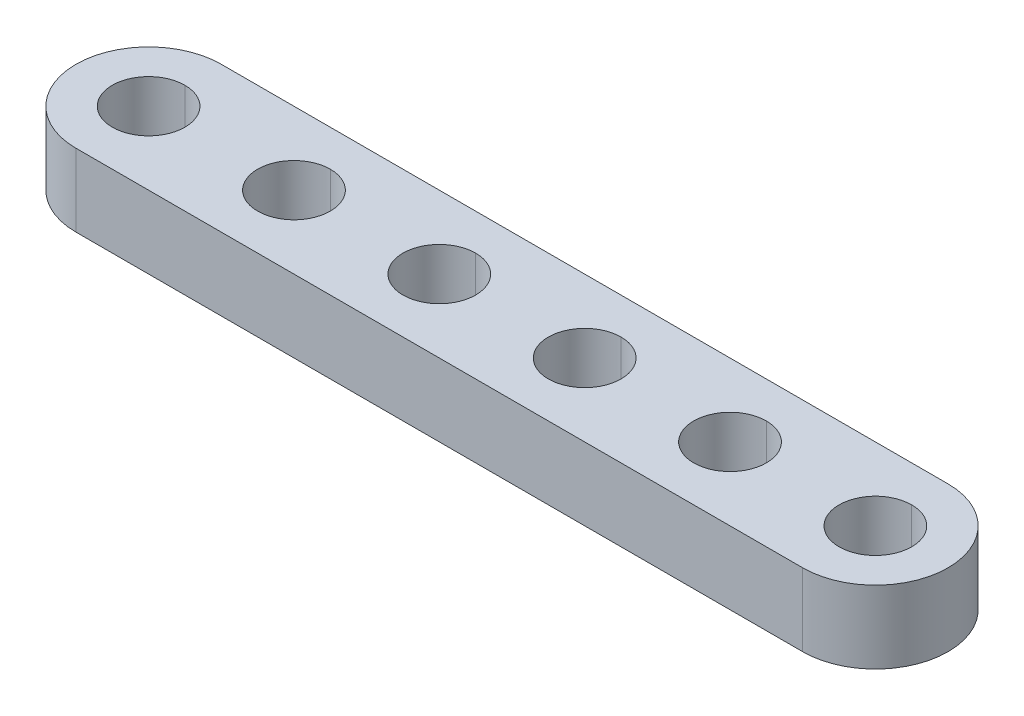
ISO-10303-21;
HEADER;
FILE_DESCRIPTION(('STEP AP214'),'2;1');
FILE_NAME('part.step','',(''),(''),'','','');
FILE_SCHEMA(('AUTOMOTIVE_DESIGN { 1 0 10303 214 1 1 1 1 }'));
ENDSEC;
DATA;
#1=APPLICATION_CONTEXT('core data for automotive mechanical design processes');
#2=APPLICATION_PROTOCOL_DEFINITION('international standard','automotive_design',2000,#1);
#3=PRODUCT_CONTEXT('',#1,'mechanical');
#4=PRODUCT('Part','Part','',(#3));
#5=PRODUCT_RELATED_PRODUCT_CATEGORY('part','',(#4));
#6=PRODUCT_DEFINITION_FORMATION('','',#4);
#7=PRODUCT_DEFINITION_CONTEXT('part definition',#1,'design');
#8=PRODUCT_DEFINITION('design','',#6,#7);
#9=PRODUCT_DEFINITION_SHAPE('','',#8);
#10=(LENGTH_UNIT() NAMED_UNIT(*) SI_UNIT(.MILLI.,.METRE.));
#11=(NAMED_UNIT(*) PLANE_ANGLE_UNIT() SI_UNIT($,.RADIAN.));
#12=(NAMED_UNIT(*) SI_UNIT($,.STERADIAN.) SOLID_ANGLE_UNIT());
#13=UNCERTAINTY_MEASURE_WITH_UNIT(LENGTH_MEASURE(1.E-05),#10,'distance_accuracy_value','');
#14=(GEOMETRIC_REPRESENTATION_CONTEXT(3) GLOBAL_UNCERTAINTY_ASSIGNED_CONTEXT((#13)) GLOBAL_UNIT_ASSIGNED_CONTEXT((#10,
#11,#12)) REPRESENTATION_CONTEXT('',''));
#15=CARTESIAN_POINT('',(0.,0.,0.));
#16=DIRECTION('',(0.,0.,1.));
#17=DIRECTION('',(1.,0.,0.));
#18=AXIS2_PLACEMENT_3D('',#15,#16,#17);
#19=CARTESIAN_POINT('',(20.,4.,0.));
#20=DIRECTION('',(0.,1.,0.));
#21=DIRECTION('',(0.,0.,1.));
#22=AXIS2_PLACEMENT_3D('',#19,#20,#21);
#23=CYLINDRICAL_SURFACE('',#22,2.);
#24=DIRECTION('',(0.,1.,0.));
#25=VECTOR('',#24,1.);
#26=CARTESIAN_POINT('',(20.,4.,-2.));
#27=LINE('',#26,#25);
#28=CARTESIAN_POINT('',(20.,0.,-2.));
#29=VERTEX_POINT('',#28);
#30=CARTESIAN_POINT('',(20.,4.,-2.));
#31=VERTEX_POINT('',#30);
#32=EDGE_CURVE('E175',#29,#31,#27,.T.);
#33=ORIENTED_EDGE('',*,*,#32,.F.);
#34=CARTESIAN_POINT('',(20.,0.,0.));
#35=DIRECTION('',(0.,1.,0.));
#36=DIRECTION('',(0.,0.,1.));
#37=AXIS2_PLACEMENT_3D('',#34,#35,#36);
#38=CIRCLE('',#37,2.);
#39=CARTESIAN_POINT('',(20.,0.,2.));
#40=VERTEX_POINT('',#39);
#41=EDGE_CURVE('E234',#40,#29,#38,.T.);
#42=ORIENTED_EDGE('',*,*,#41,.F.);
#43=DIRECTION('',(0.,1.,0.));
#44=VECTOR('',#43,1.);
#45=CARTESIAN_POINT('',(20.,4.,2.));
#46=LINE('',#45,#44);
#47=CARTESIAN_POINT('',(20.,4.,2.));
#48=VERTEX_POINT('',#47);
#49=EDGE_CURVE('E174',#40,#48,#46,.T.);
#50=ORIENTED_EDGE('',*,*,#49,.T.);
#51=CARTESIAN_POINT('',(20.,4.,0.));
#52=DIRECTION('',(0.,1.,0.));
#53=DIRECTION('',(0.,0.,1.));
#54=AXIS2_PLACEMENT_3D('',#51,#52,#53);
#55=CIRCLE('',#54,2.);
#56=EDGE_CURVE('E218',#48,#31,#55,.T.);
#57=ORIENTED_EDGE('',*,*,#56,.T.);
#58=EDGE_LOOP('',(#33,#42,#50,#57));
#59=FACE_BOUND('',#58,.T.);
#60=ADVANCED_FACE('F15',(#59),#23,.F.);
#61=CARTESIAN_POINT('',(12.,4.,0.));
#62=DIRECTION('',(0.,1.,0.));
#63=DIRECTION('',(0.,0.,1.));
#64=AXIS2_PLACEMENT_3D('',#61,#62,#63);
#65=CYLINDRICAL_SURFACE('',#64,2.);
#66=DIRECTION('',(0.,1.,0.));
#67=VECTOR('',#66,1.);
#68=CARTESIAN_POINT('',(12.,4.,-2.));
#69=LINE('',#68,#67);
#70=CARTESIAN_POINT('',(12.,0.,-2.));
#71=VERTEX_POINT('',#70);
#72=CARTESIAN_POINT('',(12.,4.,-2.));
#73=VERTEX_POINT('',#72);
#74=EDGE_CURVE('E198',#71,#73,#69,.T.);
#75=ORIENTED_EDGE('',*,*,#74,.F.);
#76=CARTESIAN_POINT('',(12.,0.,0.));
#77=DIRECTION('',(0.,1.,0.));
#78=DIRECTION('',(0.,0.,1.));
#79=AXIS2_PLACEMENT_3D('',#76,#77,#78);
#80=CIRCLE('',#79,2.);
#81=CARTESIAN_POINT('',(12.,0.,2.));
#82=VERTEX_POINT('',#81);
#83=EDGE_CURVE('E237',#82,#71,#80,.T.);
#84=ORIENTED_EDGE('',*,*,#83,.F.);
#85=DIRECTION('',(0.,1.,0.));
#86=VECTOR('',#85,1.);
#87=CARTESIAN_POINT('',(12.,4.,2.));
#88=LINE('',#87,#86);
#89=CARTESIAN_POINT('',(12.,4.,2.));
#90=VERTEX_POINT('',#89);
#91=EDGE_CURVE('E244',#82,#90,#88,.T.);
#92=ORIENTED_EDGE('',*,*,#91,.T.);
#93=CARTESIAN_POINT('',(12.,4.,0.));
#94=DIRECTION('',(0.,1.,0.));
#95=DIRECTION('',(0.,0.,1.));
#96=AXIS2_PLACEMENT_3D('',#93,#94,#95);
#97=CIRCLE('',#96,2.);
#98=EDGE_CURVE('E307',#90,#73,#97,.T.);
#99=ORIENTED_EDGE('',*,*,#98,.T.);
#100=EDGE_LOOP('',(#75,#84,#92,#99));
#101=FACE_BOUND('',#100,.T.);
#102=ADVANCED_FACE('F389',(#101),#65,.F.);
#103=CARTESIAN_POINT('',(4.,4.,0.));
#104=DIRECTION('',(0.,1.,0.));
#105=DIRECTION('',(0.,0.,1.));
#106=AXIS2_PLACEMENT_3D('',#103,#104,#105);
#107=CYLINDRICAL_SURFACE('',#106,2.);
#108=DIRECTION('',(0.,1.,0.));
#109=VECTOR('',#108,1.);
#110=CARTESIAN_POINT('',(4.,4.,-2.));
#111=LINE('',#110,#109);
#112=CARTESIAN_POINT('',(4.,0.,-2.));
#113=VERTEX_POINT('',#112);
#114=CARTESIAN_POINT('',(4.,4.,-2.));
#115=VERTEX_POINT('',#114);
#116=EDGE_CURVE('E243',#113,#115,#111,.T.);
#117=ORIENTED_EDGE('',*,*,#116,.F.);
#118=CARTESIAN_POINT('',(4.,0.,0.));
#119=DIRECTION('',(0.,1.,0.));
#120=DIRECTION('',(0.,0.,1.));
#121=AXIS2_PLACEMENT_3D('',#118,#119,#120);
#122=CIRCLE('',#121,2.);
#123=CARTESIAN_POINT('',(4.,0.,2.));
#124=VERTEX_POINT('',#123);
#125=EDGE_CURVE('E19',#124,#113,#122,.T.);
#126=ORIENTED_EDGE('',*,*,#125,.F.);
#127=DIRECTION('',(0.,1.,0.));
#128=VECTOR('',#127,1.);
#129=CARTESIAN_POINT('',(4.,4.,2.));
#130=LINE('',#129,#128);
#131=CARTESIAN_POINT('',(4.,4.,2.));
#132=VERTEX_POINT('',#131);
#133=EDGE_CURVE('E158',#124,#132,#130,.T.);
#134=ORIENTED_EDGE('',*,*,#133,.T.);
#135=CARTESIAN_POINT('',(4.,4.,0.));
#136=DIRECTION('',(0.,1.,0.));
#137=DIRECTION('',(0.,0.,1.));
#138=AXIS2_PLACEMENT_3D('',#135,#136,#137);
#139=CIRCLE('',#138,2.);
#140=EDGE_CURVE('E317',#132,#115,#139,.T.);
#141=ORIENTED_EDGE('',*,*,#140,.T.);
#142=EDGE_LOOP('',(#117,#126,#134,#141));
#143=FACE_BOUND('',#142,.T.);
#144=ADVANCED_FACE('F395',(#143),#107,.F.);
#145=CARTESIAN_POINT('',(-4.,4.,0.));
#146=DIRECTION('',(0.,1.,0.));
#147=DIRECTION('',(0.,0.,1.));
#148=AXIS2_PLACEMENT_3D('',#145,#146,#147);
#149=CYLINDRICAL_SURFACE('',#148,2.);
#150=DIRECTION('',(0.,1.,0.));
#151=VECTOR('',#150,1.);
#152=CARTESIAN_POINT('',(-4.,4.,-2.));
#153=LINE('',#152,#151);
#154=CARTESIAN_POINT('',(-4.,0.,-2.));
#155=VERTEX_POINT('',#154);
#156=CARTESIAN_POINT('',(-4.,4.,-2.));
#157=VERTEX_POINT('',#156);
#158=EDGE_CURVE('E146',#155,#157,#153,.T.);
#159=ORIENTED_EDGE('',*,*,#158,.F.);
#160=CARTESIAN_POINT('',(-4.,0.,0.));
#161=DIRECTION('',(0.,1.,0.));
#162=DIRECTION('',(0.,0.,1.));
#163=AXIS2_PLACEMENT_3D('',#160,#161,#162);
#164=CIRCLE('',#163,2.);
#165=CARTESIAN_POINT('',(-4.,0.,2.));
#166=VERTEX_POINT('',#165);
#167=EDGE_CURVE('E134',#166,#155,#164,.T.);
#168=ORIENTED_EDGE('',*,*,#167,.F.);
#169=DIRECTION('',(0.,1.,0.));
#170=VECTOR('',#169,1.);
#171=CARTESIAN_POINT('',(-4.,4.,2.));
#172=LINE('',#171,#170);
#173=CARTESIAN_POINT('',(-4.,4.,2.));
#174=VERTEX_POINT('',#173);
#175=EDGE_CURVE('E156',#166,#174,#172,.T.);
#176=ORIENTED_EDGE('',*,*,#175,.T.);
#177=CARTESIAN_POINT('',(-4.,4.,0.));
#178=DIRECTION('',(0.,1.,0.));
#179=DIRECTION('',(0.,0.,1.));
#180=AXIS2_PLACEMENT_3D('',#177,#178,#179);
#181=CIRCLE('',#180,2.);
#182=EDGE_CURVE('E148',#174,#157,#181,.T.);
#183=ORIENTED_EDGE('',*,*,#182,.T.);
#184=EDGE_LOOP('',(#159,#168,#176,#183));
#185=FACE_BOUND('',#184,.T.);
#186=ADVANCED_FACE('F147',(#185),#149,.F.);
#187=CARTESIAN_POINT('',(-12.,4.,0.));
#188=DIRECTION('',(0.,1.,0.));
#189=DIRECTION('',(0.,0.,1.));
#190=AXIS2_PLACEMENT_3D('',#187,#188,#189);
#191=CYLINDRICAL_SURFACE('',#190,2.);
#192=DIRECTION('',(0.,1.,0.));
#193=VECTOR('',#192,1.);
#194=CARTESIAN_POINT('',(-12.,4.,-2.));
#195=LINE('',#194,#193);
#196=CARTESIAN_POINT('',(-12.,0.,-2.));
#197=VERTEX_POINT('',#196);
#198=CARTESIAN_POINT('',(-12.,4.,-2.));
#199=VERTEX_POINT('',#198);
#200=EDGE_CURVE('E247',#197,#199,#195,.T.);
#201=ORIENTED_EDGE('',*,*,#200,.F.);
#202=CARTESIAN_POINT('',(-12.,0.,0.));
#203=DIRECTION('',(0.,1.,0.));
#204=DIRECTION('',(0.,0.,1.));
#205=AXIS2_PLACEMENT_3D('',#202,#203,#204);
#206=CIRCLE('',#205,2.);
#207=CARTESIAN_POINT('',(-12.,0.,2.));
#208=VERTEX_POINT('',#207);
#209=EDGE_CURVE('E26',#208,#197,#206,.T.);
#210=ORIENTED_EDGE('',*,*,#209,.F.);
#211=DIRECTION('',(0.,1.,0.));
#212=VECTOR('',#211,1.);
#213=CARTESIAN_POINT('',(-12.,4.,2.));
#214=LINE('',#213,#212);
#215=CARTESIAN_POINT('',(-12.,4.,2.));
#216=VERTEX_POINT('',#215);
#217=EDGE_CURVE('E176',#208,#216,#214,.T.);
#218=ORIENTED_EDGE('',*,*,#217,.T.);
#219=CARTESIAN_POINT('',(-12.,4.,0.));
#220=DIRECTION('',(0.,1.,0.));
#221=DIRECTION('',(0.,0.,1.));
#222=AXIS2_PLACEMENT_3D('',#219,#220,#221);
#223=CIRCLE('',#222,2.);
#224=EDGE_CURVE('E235',#216,#199,#223,.T.);
#225=ORIENTED_EDGE('',*,*,#224,.T.);
#226=EDGE_LOOP('',(#201,#210,#218,#225));
#227=FACE_BOUND('',#226,.T.);
#228=ADVANCED_FACE('F437',(#227),#191,.F.);
#229=CARTESIAN_POINT('',(-20.,4.,0.));
#230=DIRECTION('',(0.,1.,0.));
#231=DIRECTION('',(0.,0.,1.));
#232=AXIS2_PLACEMENT_3D('',#229,#230,#231);
#233=CYLINDRICAL_SURFACE('',#232,2.);
#234=DIRECTION('',(0.,1.,0.));
#235=VECTOR('',#234,1.);
#236=CARTESIAN_POINT('',(-20.,4.,-2.));
#237=LINE('',#236,#235);
#238=CARTESIAN_POINT('',(-20.,0.,-2.));
#239=VERTEX_POINT('',#238);
#240=CARTESIAN_POINT('',(-20.,4.,-2.));
#241=VERTEX_POINT('',#240);
#242=EDGE_CURVE('E275',#239,#241,#237,.T.);
#243=ORIENTED_EDGE('',*,*,#242,.F.);
#244=CARTESIAN_POINT('',(-20.,0.,0.));
#245=DIRECTION('',(0.,1.,0.));
#246=DIRECTION('',(0.,0.,1.));
#247=AXIS2_PLACEMENT_3D('',#244,#245,#246);
#248=CIRCLE('',#247,2.);
#249=CARTESIAN_POINT('',(-20.,0.,2.));
#250=VERTEX_POINT('',#249);
#251=EDGE_CURVE('E10',#250,#239,#248,.T.);
#252=ORIENTED_EDGE('',*,*,#251,.F.);
#253=DIRECTION('',(0.,1.,0.));
#254=VECTOR('',#253,1.);
#255=CARTESIAN_POINT('',(-20.,4.,2.));
#256=LINE('',#255,#254);
#257=CARTESIAN_POINT('',(-20.,4.,2.));
#258=VERTEX_POINT('',#257);
#259=EDGE_CURVE('E182',#250,#258,#256,.T.);
#260=ORIENTED_EDGE('',*,*,#259,.T.);
#261=CARTESIAN_POINT('',(-20.,4.,0.));
#262=DIRECTION('',(0.,1.,0.));
#263=DIRECTION('',(0.,0.,1.));
#264=AXIS2_PLACEMENT_3D('',#261,#262,#263);
#265=CIRCLE('',#264,2.);
#266=EDGE_CURVE('E231',#258,#241,#265,.T.);
#267=ORIENTED_EDGE('',*,*,#266,.T.);
#268=EDGE_LOOP('',(#243,#252,#260,#267));
#269=FACE_BOUND('',#268,.T.);
#270=ADVANCED_FACE('F439',(#269),#233,.F.);
#271=CARTESIAN_POINT('',(-20.,0.,0.));
#272=DIRECTION('',(0.,1.,0.));
#273=DIRECTION('',(1.,0.,0.));
#274=AXIS2_PLACEMENT_3D('',#271,#272,#273);
#275=PLANE('',#274);
#276=ORIENTED_EDGE('',*,*,#251,.T.);
#277=CARTESIAN_POINT('',(-20.,0.,0.));
#278=DIRECTION('',(0.,1.,0.));
#279=DIRECTION('',(0.,0.,1.));
#280=AXIS2_PLACEMENT_3D('',#277,#278,#279);
#281=CIRCLE('',#280,2.);
#282=EDGE_CURVE('E180',#239,#250,#281,.T.);
#283=ORIENTED_EDGE('',*,*,#282,.T.);
#284=EDGE_LOOP('',(#276,#283));
#285=FACE_BOUND('',#284,.T.);
#286=ORIENTED_EDGE('',*,*,#209,.T.);
#287=CARTESIAN_POINT('',(-12.,0.,0.));
#288=DIRECTION('',(0.,1.,0.));
#289=DIRECTION('',(0.,0.,1.));
#290=AXIS2_PLACEMENT_3D('',#287,#288,#289);
#291=CIRCLE('',#290,2.);
#292=EDGE_CURVE('E256',#197,#208,#291,.T.);
#293=ORIENTED_EDGE('',*,*,#292,.T.);
#294=EDGE_LOOP('',(#286,#293));
#295=FACE_BOUND('',#294,.T.);
#296=ORIENTED_EDGE('',*,*,#167,.T.);
#297=CARTESIAN_POINT('',(-4.,0.,0.));
#298=DIRECTION('',(0.,1.,0.));
#299=DIRECTION('',(0.,0.,1.));
#300=AXIS2_PLACEMENT_3D('',#297,#298,#299);
#301=CIRCLE('',#300,2.);
#302=EDGE_CURVE('E139',#155,#166,#301,.T.);
#303=ORIENTED_EDGE('',*,*,#302,.T.);
#304=EDGE_LOOP('',(#296,#303));
#305=FACE_BOUND('',#304,.T.);
#306=ORIENTED_EDGE('',*,*,#125,.T.);
#307=CARTESIAN_POINT('',(4.,0.,0.));
#308=DIRECTION('',(0.,1.,0.));
#309=DIRECTION('',(0.,0.,1.));
#310=AXIS2_PLACEMENT_3D('',#307,#308,#309);
#311=CIRCLE('',#310,2.);
#312=EDGE_CURVE('E240',#113,#124,#311,.T.);
#313=ORIENTED_EDGE('',*,*,#312,.T.);
#314=EDGE_LOOP('',(#306,#313));
#315=FACE_BOUND('',#314,.T.);
#316=ORIENTED_EDGE('',*,*,#83,.T.);
#317=CARTESIAN_POINT('',(12.,0.,0.));
#318=DIRECTION('',(0.,1.,0.));
#319=DIRECTION('',(0.,0.,1.));
#320=AXIS2_PLACEMENT_3D('',#317,#318,#319);
#321=CIRCLE('',#320,2.);
#322=EDGE_CURVE('E194',#71,#82,#321,.T.);
#323=ORIENTED_EDGE('',*,*,#322,.T.);
#324=EDGE_LOOP('',(#316,#323));
#325=FACE_BOUND('',#324,.T.);
#326=ORIENTED_EDGE('',*,*,#41,.T.);
#327=CARTESIAN_POINT('',(20.,0.,0.));
#328=DIRECTION('',(0.,1.,0.));
#329=DIRECTION('',(0.,0.,1.));
#330=AXIS2_PLACEMENT_3D('',#327,#328,#329);
#331=CIRCLE('',#330,2.);
#332=EDGE_CURVE('E215',#29,#40,#331,.T.);
#333=ORIENTED_EDGE('',*,*,#332,.T.);
#334=EDGE_LOOP('',(#326,#333));
#335=FACE_BOUND('',#334,.T.);
#336=CARTESIAN_POINT('',(-20.,0.,0.));
#337=DIRECTION('',(0.,1.,0.));
#338=DIRECTION('',(0.,0.,1.));
#339=AXIS2_PLACEMENT_3D('',#336,#337,#338);
#340=CIRCLE('',#339,4.);
#341=CARTESIAN_POINT('',(-20.,0.,-4.));
#342=VERTEX_POINT('',#341);
#343=CARTESIAN_POINT('',(-20.,0.,4.));
#344=VERTEX_POINT('',#343);
#345=EDGE_CURVE('E185',#342,#344,#340,.T.);
#346=ORIENTED_EDGE('',*,*,#345,.F.);
#347=DIRECTION('',(-1.,0.,0.));
#348=VECTOR('',#347,1.);
#349=CARTESIAN_POINT('',(-20.,0.,-4.));
#350=LINE('',#349,#348);
#351=CARTESIAN_POINT('',(20.,0.,-4.));
#352=VERTEX_POINT('',#351);
#353=EDGE_CURVE('E219',#352,#342,#350,.T.);
#354=ORIENTED_EDGE('',*,*,#353,.F.);
#355=CARTESIAN_POINT('',(20.,0.,0.));
#356=DIRECTION('',(0.,1.,0.));
#357=DIRECTION('',(0.,0.,1.));
#358=AXIS2_PLACEMENT_3D('',#355,#356,#357);
#359=CIRCLE('',#358,4.);
#360=CARTESIAN_POINT('',(20.,0.,4.));
#361=VERTEX_POINT('',#360);
#362=EDGE_CURVE('E210',#361,#352,#359,.T.);
#363=ORIENTED_EDGE('',*,*,#362,.F.);
#364=DIRECTION('',(1.,0.,0.));
#365=VECTOR('',#364,1.);
#366=CARTESIAN_POINT('',(-20.,0.,4.));
#367=LINE('',#366,#365);
#368=EDGE_CURVE('E192',#344,#361,#367,.T.);
#369=ORIENTED_EDGE('',*,*,#368,.F.);
#370=EDGE_LOOP('',(#346,#354,#363,#369));
#371=FACE_BOUND('',#370,.T.);
#372=ADVANCED_FACE('F136',(#285,#295,#305,#315,#325,#335,#371),#275,.F.);
#373=CARTESIAN_POINT('',(-20.,4.,0.));
#374=DIRECTION('',(0.,1.,0.));
#375=DIRECTION('',(1.,0.,0.));
#376=AXIS2_PLACEMENT_3D('',#373,#374,#375);
#377=PLANE('',#376);
#378=ORIENTED_EDGE('',*,*,#266,.F.);
#379=CARTESIAN_POINT('',(-20.,4.,0.));
#380=DIRECTION('',(0.,1.,0.));
#381=DIRECTION('',(0.,0.,1.));
#382=AXIS2_PLACEMENT_3D('',#379,#380,#381);
#383=CIRCLE('',#382,2.);
#384=EDGE_CURVE('E186',#241,#258,#383,.T.);
#385=ORIENTED_EDGE('',*,*,#384,.F.);
#386=EDGE_LOOP('',(#378,#385));
#387=FACE_BOUND('',#386,.T.);
#388=ORIENTED_EDGE('',*,*,#224,.F.);
#389=CARTESIAN_POINT('',(-12.,4.,0.));
#390=DIRECTION('',(0.,1.,0.));
#391=DIRECTION('',(0.,0.,1.));
#392=AXIS2_PLACEMENT_3D('',#389,#390,#391);
#393=CIRCLE('',#392,2.);
#394=EDGE_CURVE('E181',#199,#216,#393,.T.);
#395=ORIENTED_EDGE('',*,*,#394,.F.);
#396=EDGE_LOOP('',(#388,#395));
#397=FACE_BOUND('',#396,.T.);
#398=ORIENTED_EDGE('',*,*,#182,.F.);
#399=CARTESIAN_POINT('',(-4.,4.,0.));
#400=DIRECTION('',(0.,1.,0.));
#401=DIRECTION('',(0.,0.,1.));
#402=AXIS2_PLACEMENT_3D('',#399,#400,#401);
#403=CIRCLE('',#402,2.);
#404=EDGE_CURVE('E153',#157,#174,#403,.T.);
#405=ORIENTED_EDGE('',*,*,#404,.F.);
#406=EDGE_LOOP('',(#398,#405));
#407=FACE_BOUND('',#406,.T.);
#408=ORIENTED_EDGE('',*,*,#140,.F.);
#409=CARTESIAN_POINT('',(4.,4.,0.));
#410=DIRECTION('',(0.,1.,0.));
#411=DIRECTION('',(0.,0.,1.));
#412=AXIS2_PLACEMENT_3D('',#409,#410,#411);
#413=CIRCLE('',#412,2.);
#414=EDGE_CURVE('E166',#115,#132,#413,.T.);
#415=ORIENTED_EDGE('',*,*,#414,.F.);
#416=EDGE_LOOP('',(#408,#415));
#417=FACE_BOUND('',#416,.T.);
#418=ORIENTED_EDGE('',*,*,#98,.F.);
#419=CARTESIAN_POINT('',(12.,4.,0.));
#420=DIRECTION('',(0.,1.,0.));
#421=DIRECTION('',(0.,0.,1.));
#422=AXIS2_PLACEMENT_3D('',#419,#420,#421);
#423=CIRCLE('',#422,2.);
#424=EDGE_CURVE('E226',#73,#90,#423,.T.);
#425=ORIENTED_EDGE('',*,*,#424,.F.);
#426=EDGE_LOOP('',(#418,#425));
#427=FACE_BOUND('',#426,.T.);
#428=ORIENTED_EDGE('',*,*,#56,.F.);
#429=CARTESIAN_POINT('',(20.,4.,0.));
#430=DIRECTION('',(0.,1.,0.));
#431=DIRECTION('',(0.,0.,1.));
#432=AXIS2_PLACEMENT_3D('',#429,#430,#431);
#433=CIRCLE('',#432,2.);
#434=EDGE_CURVE('E171',#31,#48,#433,.T.);
#435=ORIENTED_EDGE('',*,*,#434,.F.);
#436=EDGE_LOOP('',(#428,#435));
#437=FACE_BOUND('',#436,.T.);
#438=CARTESIAN_POINT('',(-20.,4.,0.));
#439=DIRECTION('',(0.,1.,0.));
#440=DIRECTION('',(0.,0.,1.));
#441=AXIS2_PLACEMENT_3D('',#438,#439,#440);
#442=CIRCLE('',#441,4.);
#443=CARTESIAN_POINT('',(-20.,4.,-4.));
#444=VERTEX_POINT('',#443);
#445=CARTESIAN_POINT('',(-20.,4.,4.));
#446=VERTEX_POINT('',#445);
#447=EDGE_CURVE('E193',#444,#446,#442,.T.);
#448=ORIENTED_EDGE('',*,*,#447,.T.);
#449=DIRECTION('',(1.,0.,0.));
#450=VECTOR('',#449,1.);
#451=CARTESIAN_POINT('',(-20.,4.,4.));
#452=LINE('',#451,#450);
#453=CARTESIAN_POINT('',(20.,4.,4.));
#454=VERTEX_POINT('',#453);
#455=EDGE_CURVE('E206',#446,#454,#452,.T.);
#456=ORIENTED_EDGE('',*,*,#455,.T.);
#457=CARTESIAN_POINT('',(20.,4.,0.));
#458=DIRECTION('',(0.,1.,0.));
#459=DIRECTION('',(0.,0.,1.));
#460=AXIS2_PLACEMENT_3D('',#457,#458,#459);
#461=CIRCLE('',#460,4.);
#462=CARTESIAN_POINT('',(20.,4.,-4.));
#463=VERTEX_POINT('',#462);
#464=EDGE_CURVE('E289',#454,#463,#461,.T.);
#465=ORIENTED_EDGE('',*,*,#464,.T.);
#466=DIRECTION('',(-1.,0.,0.));
#467=VECTOR('',#466,1.);
#468=CARTESIAN_POINT('',(-20.,4.,-4.));
#469=LINE('',#468,#467);
#470=EDGE_CURVE('E41',#463,#444,#469,.T.);
#471=ORIENTED_EDGE('',*,*,#470,.T.);
#472=EDGE_LOOP('',(#448,#456,#465,#471));
#473=FACE_BOUND('',#472,.T.);
#474=ADVANCED_FACE('F347',(#387,#397,#407,#417,#427,#437,#473),#377,.T.);
#475=CARTESIAN_POINT('',(-20.,4.,-4.));
#476=DIRECTION('',(0.,0.,1.));
#477=DIRECTION('',(1.,0.,0.));
#478=AXIS2_PLACEMENT_3D('',#475,#476,#477);
#479=PLANE('',#478);
#480=ORIENTED_EDGE('',*,*,#353,.T.);
#481=DIRECTION('',(0.,-1.,0.));
#482=VECTOR('',#481,1.);
#483=CARTESIAN_POINT('',(-20.,4.,-4.));
#484=LINE('',#483,#482);
#485=EDGE_CURVE('E188',#444,#342,#484,.T.);
#486=ORIENTED_EDGE('',*,*,#485,.F.);
#487=ORIENTED_EDGE('',*,*,#470,.F.);
#488=DIRECTION('',(0.,-1.,0.));
#489=VECTOR('',#488,1.);
#490=CARTESIAN_POINT('',(20.,4.,-4.));
#491=LINE('',#490,#489);
#492=EDGE_CURVE('E230',#463,#352,#491,.T.);
#493=ORIENTED_EDGE('',*,*,#492,.T.);
#494=EDGE_LOOP('',(#480,#486,#487,#493));
#495=FACE_BOUND('',#494,.T.);
#496=ADVANCED_FACE('F377',(#495),#479,.F.);
#497=CARTESIAN_POINT('',(20.,4.,0.));
#498=DIRECTION('',(0.,-1.,0.));
#499=DIRECTION('',(0.,0.,-1.));
#500=AXIS2_PLACEMENT_3D('',#497,#498,#499);
#501=CYLINDRICAL_SURFACE('',#500,4.);
#502=ORIENTED_EDGE('',*,*,#362,.T.);
#503=ORIENTED_EDGE('',*,*,#492,.F.);
#504=ORIENTED_EDGE('',*,*,#464,.F.);
#505=DIRECTION('',(0.,-1.,0.));
#506=VECTOR('',#505,1.);
#507=CARTESIAN_POINT('',(20.,4.,4.));
#508=LINE('',#507,#506);
#509=EDGE_CURVE('E211',#454,#361,#508,.T.);
#510=ORIENTED_EDGE('',*,*,#509,.T.);
#511=EDGE_LOOP('',(#502,#503,#504,#510));
#512=FACE_BOUND('',#511,.T.);
#513=ADVANCED_FACE('F17',(#512),#501,.T.);
#514=CARTESIAN_POINT('',(-20.,4.,4.));
#515=DIRECTION('',(0.,0.,-1.));
#516=DIRECTION('',(0.,-1.,0.));
#517=AXIS2_PLACEMENT_3D('',#514,#515,#516);
#518=PLANE('',#517);
#519=ORIENTED_EDGE('',*,*,#368,.T.);
#520=ORIENTED_EDGE('',*,*,#509,.F.);
#521=ORIENTED_EDGE('',*,*,#455,.F.);
#522=DIRECTION('',(0.,-1.,0.));
#523=VECTOR('',#522,1.);
#524=CARTESIAN_POINT('',(-20.,4.,4.));
#525=LINE('',#524,#523);
#526=EDGE_CURVE('E201',#446,#344,#525,.T.);
#527=ORIENTED_EDGE('',*,*,#526,.T.);
#528=EDGE_LOOP('',(#519,#520,#521,#527));
#529=FACE_BOUND('',#528,.T.);
#530=ADVANCED_FACE('F374',(#529),#518,.F.);
#531=CARTESIAN_POINT('',(-20.,4.,0.));
#532=DIRECTION('',(0.,-1.,0.));
#533=DIRECTION('',(0.,0.,-1.));
#534=AXIS2_PLACEMENT_3D('',#531,#532,#533);
#535=CYLINDRICAL_SURFACE('',#534,4.);
#536=ORIENTED_EDGE('',*,*,#345,.T.);
#537=ORIENTED_EDGE('',*,*,#526,.F.);
#538=ORIENTED_EDGE('',*,*,#447,.F.);
#539=ORIENTED_EDGE('',*,*,#485,.T.);
#540=EDGE_LOOP('',(#536,#537,#538,#539));
#541=FACE_BOUND('',#540,.T.);
#542=ADVANCED_FACE('F400',(#541),#535,.T.);
#543=CARTESIAN_POINT('',(-20.,4.,0.));
#544=DIRECTION('',(0.,1.,0.));
#545=DIRECTION('',(0.,0.,1.));
#546=AXIS2_PLACEMENT_3D('',#543,#544,#545);
#547=CYLINDRICAL_SURFACE('',#546,2.);
#548=ORIENTED_EDGE('',*,*,#282,.F.);
#549=ORIENTED_EDGE('',*,*,#242,.T.);
#550=ORIENTED_EDGE('',*,*,#384,.T.);
#551=ORIENTED_EDGE('',*,*,#259,.F.);
#552=EDGE_LOOP('',(#548,#549,#550,#551));
#553=FACE_BOUND('',#552,.T.);
#554=ADVANCED_FACE('F341',(#553),#547,.F.);
#555=CARTESIAN_POINT('',(-12.,4.,0.));
#556=DIRECTION('',(0.,1.,0.));
#557=DIRECTION('',(0.,0.,1.));
#558=AXIS2_PLACEMENT_3D('',#555,#556,#557);
#559=CYLINDRICAL_SURFACE('',#558,2.);
#560=ORIENTED_EDGE('',*,*,#292,.F.);
#561=ORIENTED_EDGE('',*,*,#200,.T.);
#562=ORIENTED_EDGE('',*,*,#394,.T.);
#563=ORIENTED_EDGE('',*,*,#217,.F.);
#564=EDGE_LOOP('',(#560,#561,#562,#563));
#565=FACE_BOUND('',#564,.T.);
#566=ADVANCED_FACE('F407',(#565),#559,.F.);
#567=CARTESIAN_POINT('',(-4.,4.,0.));
#568=DIRECTION('',(0.,1.,0.));
#569=DIRECTION('',(0.,0.,1.));
#570=AXIS2_PLACEMENT_3D('',#567,#568,#569);
#571=CYLINDRICAL_SURFACE('',#570,2.);
#572=ORIENTED_EDGE('',*,*,#302,.F.);
#573=ORIENTED_EDGE('',*,*,#158,.T.);
#574=ORIENTED_EDGE('',*,*,#404,.T.);
#575=ORIENTED_EDGE('',*,*,#175,.F.);
#576=EDGE_LOOP('',(#572,#573,#574,#575));
#577=FACE_BOUND('',#576,.T.);
#578=ADVANCED_FACE('F155',(#577),#571,.F.);
#579=CARTESIAN_POINT('',(4.,4.,0.));
#580=DIRECTION('',(0.,1.,0.));
#581=DIRECTION('',(0.,0.,1.));
#582=AXIS2_PLACEMENT_3D('',#579,#580,#581);
#583=CYLINDRICAL_SURFACE('',#582,2.);
#584=ORIENTED_EDGE('',*,*,#312,.F.);
#585=ORIENTED_EDGE('',*,*,#116,.T.);
#586=ORIENTED_EDGE('',*,*,#414,.T.);
#587=ORIENTED_EDGE('',*,*,#133,.F.);
#588=EDGE_LOOP('',(#584,#585,#586,#587));
#589=FACE_BOUND('',#588,.T.);
#590=ADVANCED_FACE('F430',(#589),#583,.F.);
#591=CARTESIAN_POINT('',(12.,4.,0.));
#592=DIRECTION('',(0.,1.,0.));
#593=DIRECTION('',(0.,0.,1.));
#594=AXIS2_PLACEMENT_3D('',#591,#592,#593);
#595=CYLINDRICAL_SURFACE('',#594,2.);
#596=ORIENTED_EDGE('',*,*,#322,.F.);
#597=ORIENTED_EDGE('',*,*,#74,.T.);
#598=ORIENTED_EDGE('',*,*,#424,.T.);
#599=ORIENTED_EDGE('',*,*,#91,.F.);
#600=EDGE_LOOP('',(#596,#597,#598,#599));
#601=FACE_BOUND('',#600,.T.);
#602=ADVANCED_FACE('F425',(#601),#595,.F.);
#603=CARTESIAN_POINT('',(20.,4.,0.));
#604=DIRECTION('',(0.,1.,0.));
#605=DIRECTION('',(0.,0.,1.));
#606=AXIS2_PLACEMENT_3D('',#603,#604,#605);
#607=CYLINDRICAL_SURFACE('',#606,2.);
#608=ORIENTED_EDGE('',*,*,#332,.F.);
#609=ORIENTED_EDGE('',*,*,#32,.T.);
#610=ORIENTED_EDGE('',*,*,#434,.T.);
#611=ORIENTED_EDGE('',*,*,#49,.F.);
#612=EDGE_LOOP('',(#608,#609,#610,#611));
#613=FACE_BOUND('',#612,.T.);
#614=ADVANCED_FACE('F422',(#613),#607,.F.);
#615=CLOSED_SHELL('',(#60,#102,#144,#186,#228,#270,#372,#474,#496,#513,#530,#542,#554,#566,#578,
#590,#602,#614));
#616=MANIFOLD_SOLID_BREP('B1',#615);
#617=ADVANCED_BREP_SHAPE_REPRESENTATION('',(#18,#616),#14);
#618=SHAPE_DEFINITION_REPRESENTATION(#9,#617);
ENDSEC;
END-ISO-10303-21;
